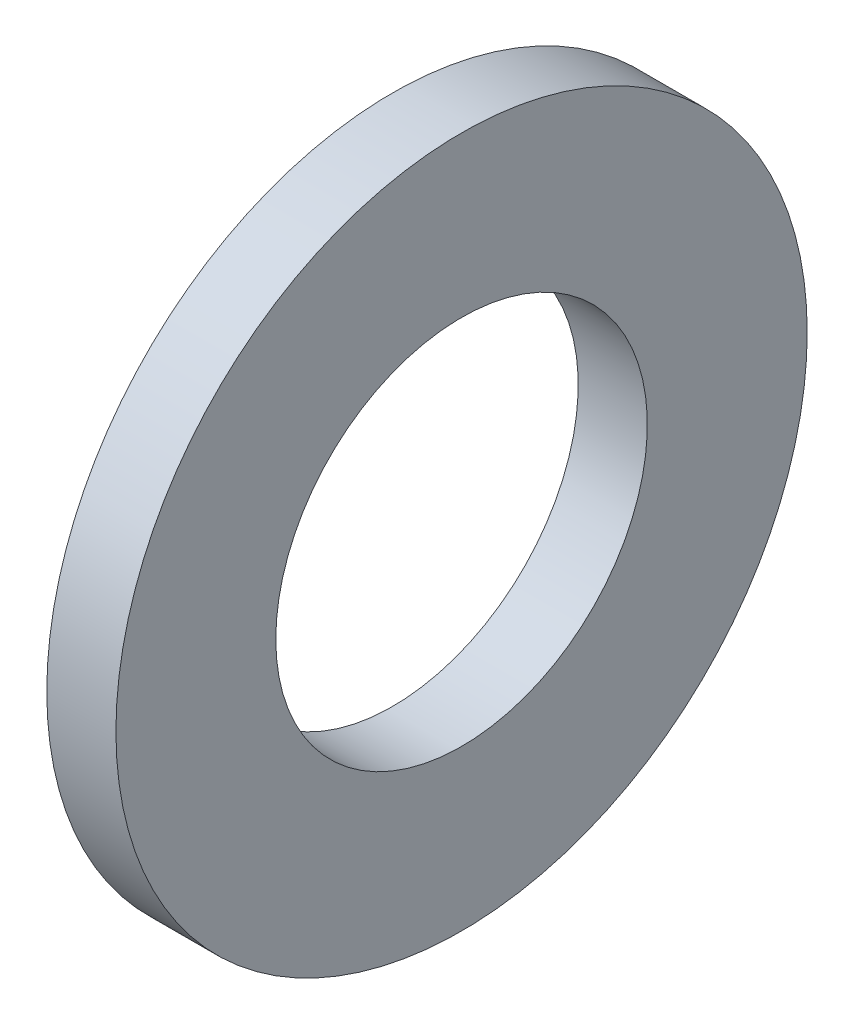
ISO-10303-21;
HEADER;
FILE_DESCRIPTION(('STEP AP214'),'2;1');
FILE_NAME('part.step','',(''),(''),'','','');
FILE_SCHEMA(('AUTOMOTIVE_DESIGN { 1 0 10303 214 1 1 1 1 }'));
ENDSEC;
DATA;
#1=APPLICATION_CONTEXT('core data for automotive mechanical design processes');
#2=APPLICATION_PROTOCOL_DEFINITION('international standard','automotive_design',2000,#1);
#3=PRODUCT_CONTEXT('',#1,'mechanical');
#4=PRODUCT('Part','Part','',(#3));
#5=PRODUCT_RELATED_PRODUCT_CATEGORY('part','',(#4));
#6=PRODUCT_DEFINITION_FORMATION('','',#4);
#7=PRODUCT_DEFINITION_CONTEXT('part definition',#1,'design');
#8=PRODUCT_DEFINITION('design','',#6,#7);
#9=PRODUCT_DEFINITION_SHAPE('','',#8);
#10=(LENGTH_UNIT() NAMED_UNIT(*) SI_UNIT(.MILLI.,.METRE.));
#11=(NAMED_UNIT(*) PLANE_ANGLE_UNIT() SI_UNIT($,.RADIAN.));
#12=(NAMED_UNIT(*) SI_UNIT($,.STERADIAN.) SOLID_ANGLE_UNIT());
#13=UNCERTAINTY_MEASURE_WITH_UNIT(LENGTH_MEASURE(1.E-05),#10,'distance_accuracy_value','');
#14=(GEOMETRIC_REPRESENTATION_CONTEXT(3) GLOBAL_UNCERTAINTY_ASSIGNED_CONTEXT((#13)) GLOBAL_UNIT_ASSIGNED_CONTEXT((#10,
#11,#12)) REPRESENTATION_CONTEXT('',''));
#15=CARTESIAN_POINT('',(0.,0.,0.));
#16=DIRECTION('',(0.,0.,1.));
#17=DIRECTION('',(1.,0.,0.));
#18=AXIS2_PLACEMENT_3D('',#15,#16,#17);
#19=CARTESIAN_POINT('',(0.,0.,-4.));
#20=DIRECTION('',(1.,0.,0.));
#21=DIRECTION('',(0.,0.,-1.));
#22=AXIS2_PLACEMENT_3D('',#19,#20,#21);
#23=PLANE('',#22);
#24=CARTESIAN_POINT('',(0.,0.,0.));
#25=DIRECTION('',(-1.,0.,0.));
#26=DIRECTION('',(0.,0.,1.));
#27=AXIS2_PLACEMENT_3D('',#24,#25,#26);
#28=CIRCLE('',#27,2.15);
#29=CARTESIAN_POINT('',(0.,0.,2.15));
#30=VERTEX_POINT('',#29);
#31=EDGE_CURVE('E10',#30,#30,#28,.T.);
#32=ORIENTED_EDGE('',*,*,#31,.F.);
#33=EDGE_LOOP('',(#32));
#34=FACE_BOUND('',#33,.T.);
#35=CARTESIAN_POINT('',(0.,0.,0.));
#36=DIRECTION('',(-1.,0.,0.));
#37=DIRECTION('',(0.,0.,1.));
#38=AXIS2_PLACEMENT_3D('',#35,#36,#37);
#39=CIRCLE('',#38,4.);
#40=CARTESIAN_POINT('',(0.,0.,4.));
#41=VERTEX_POINT('',#40);
#42=EDGE_CURVE('E45',#41,#41,#39,.T.);
#43=ORIENTED_EDGE('',*,*,#42,.T.);
#44=EDGE_LOOP('',(#43));
#45=FACE_BOUND('',#44,.T.);
#46=ADVANCED_FACE('F31',(#34,#45),#23,.F.);
#47=CARTESIAN_POINT('',(0.,0.,0.));
#48=DIRECTION('',(-1.,0.,0.));
#49=DIRECTION('',(0.,0.,1.));
#50=AXIS2_PLACEMENT_3D('',#47,#48,#49);
#51=CYLINDRICAL_SURFACE('',#50,2.15);
#52=CARTESIAN_POINT('',(0.8,0.,0.));
#53=DIRECTION('',(-1.,0.,0.));
#54=DIRECTION('',(0.,0.,1.));
#55=AXIS2_PLACEMENT_3D('',#52,#53,#54);
#56=CIRCLE('',#55,2.15);
#57=CARTESIAN_POINT('',(0.8,0.,2.15));
#58=VERTEX_POINT('',#57);
#59=EDGE_CURVE('E37',#58,#58,#56,.T.);
#60=ORIENTED_EDGE('',*,*,#59,.F.);
#61=EDGE_LOOP('',(#60));
#62=FACE_BOUND('',#61,.T.);
#63=ORIENTED_EDGE('',*,*,#31,.T.);
#64=EDGE_LOOP('',(#63));
#65=FACE_BOUND('',#64,.T.);
#66=ADVANCED_FACE('F60',(#62,#65),#51,.F.);
#67=CARTESIAN_POINT('',(0.8,0.,-4.));
#68=DIRECTION('',(-1.,0.,0.));
#69=DIRECTION('',(0.,0.,1.));
#70=AXIS2_PLACEMENT_3D('',#67,#68,#69);
#71=PLANE('',#70);
#72=CARTESIAN_POINT('',(0.8,0.,0.));
#73=DIRECTION('',(-1.,0.,0.));
#74=DIRECTION('',(0.,0.,1.));
#75=AXIS2_PLACEMENT_3D('',#72,#73,#74);
#76=CIRCLE('',#75,4.);
#77=CARTESIAN_POINT('',(0.8,0.,4.));
#78=VERTEX_POINT('',#77);
#79=EDGE_CURVE('E41',#78,#78,#76,.T.);
#80=ORIENTED_EDGE('',*,*,#79,.F.);
#81=EDGE_LOOP('',(#80));
#82=FACE_BOUND('',#81,.T.);
#83=ORIENTED_EDGE('',*,*,#59,.T.);
#84=EDGE_LOOP('',(#83));
#85=FACE_BOUND('',#84,.T.);
#86=ADVANCED_FACE('F55',(#82,#85),#71,.F.);
#87=CARTESIAN_POINT('',(0.,0.,0.));
#88=DIRECTION('',(-1.,0.,0.));
#89=DIRECTION('',(0.,0.,1.));
#90=AXIS2_PLACEMENT_3D('',#87,#88,#89);
#91=CYLINDRICAL_SURFACE('',#90,4.);
#92=ORIENTED_EDGE('',*,*,#42,.F.);
#93=EDGE_LOOP('',(#92));
#94=FACE_BOUND('',#93,.T.);
#95=ORIENTED_EDGE('',*,*,#79,.T.);
#96=EDGE_LOOP('',(#95));
#97=FACE_BOUND('',#96,.T.);
#98=ADVANCED_FACE('F52',(#94,#97),#91,.T.);
#99=CLOSED_SHELL('',(#46,#66,#86,#98));
#100=MANIFOLD_SOLID_BREP('B2',#99);
#101=ADVANCED_BREP_SHAPE_REPRESENTATION('',(#18,#100),#14);
#102=SHAPE_DEFINITION_REPRESENTATION(#9,#101);
ENDSEC;
END-ISO-10303-21;
